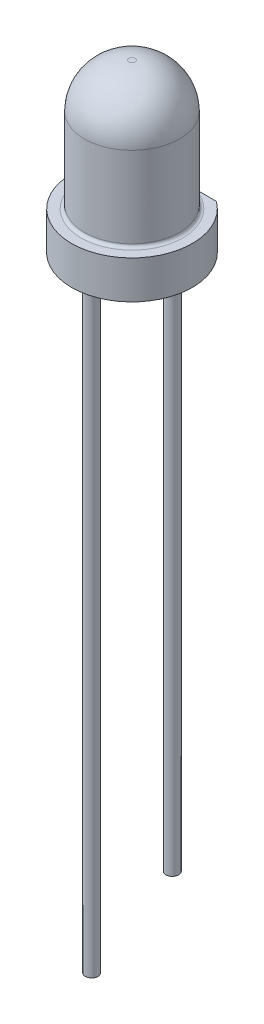
ISO-10303-21;
HEADER;
FILE_DESCRIPTION(('STEP AP214'),'2;1');
FILE_NAME('part.step','',(''),(''),'','','');
FILE_SCHEMA(('AUTOMOTIVE_DESIGN { 1 0 10303 214 1 1 1 1 }'));
ENDSEC;
DATA;
#1=APPLICATION_CONTEXT('core data for automotive mechanical design processes');
#2=APPLICATION_PROTOCOL_DEFINITION('international standard','automotive_design',2000,#1);
#3=PRODUCT_CONTEXT('',#1,'mechanical');
#4=PRODUCT('Part','Part','',(#3));
#5=PRODUCT_RELATED_PRODUCT_CATEGORY('part','',(#4));
#6=PRODUCT_DEFINITION_FORMATION('','',#4);
#7=PRODUCT_DEFINITION_CONTEXT('part definition',#1,'design');
#8=PRODUCT_DEFINITION('design','',#6,#7);
#9=PRODUCT_DEFINITION_SHAPE('','',#8);
#10=(LENGTH_UNIT() NAMED_UNIT(*) SI_UNIT(.MILLI.,.METRE.));
#11=(NAMED_UNIT(*) PLANE_ANGLE_UNIT() SI_UNIT($,.RADIAN.));
#12=(NAMED_UNIT(*) SI_UNIT($,.STERADIAN.) SOLID_ANGLE_UNIT());
#13=UNCERTAINTY_MEASURE_WITH_UNIT(LENGTH_MEASURE(1.E-05),#10,'distance_accuracy_value','');
#14=(GEOMETRIC_REPRESENTATION_CONTEXT(3) GLOBAL_UNCERTAINTY_ASSIGNED_CONTEXT((#13)) GLOBAL_UNIT_ASSIGNED_CONTEXT((#10,
#11,#12)) REPRESENTATION_CONTEXT('',''));
#15=CARTESIAN_POINT('',(0.,0.,0.));
#16=DIRECTION('',(0.,0.,1.));
#17=DIRECTION('',(1.,0.,0.));
#18=AXIS2_PLACEMENT_3D('',#15,#16,#17);
#19=CARTESIAN_POINT('',(0.,0.,0.));
#20=DIRECTION('',(0.,-1.,0.));
#21=DIRECTION('',(0.,0.,-1.));
#22=AXIS2_PLACEMENT_3D('',#19,#20,#21);
#23=PLANE('',#22);
#24=CARTESIAN_POINT('',(0.,0.,-1.27));
#25=DIRECTION('',(0.,-1.,0.));
#26=DIRECTION('',(0.,0.,-1.));
#27=AXIS2_PLACEMENT_3D('',#24,#25,#26);
#28=CIRCLE('',#27,0.2);
#29=CARTESIAN_POINT('',(0.,0.,-1.47));
#30=VERTEX_POINT('',#29);
#31=EDGE_CURVE('E313',#30,#30,#28,.T.);
#32=ORIENTED_EDGE('',*,*,#31,.F.);
#33=EDGE_LOOP('',(#32));
#34=FACE_BOUND('',#33,.T.);
#35=CARTESIAN_POINT('',(0.,0.,1.27));
#36=DIRECTION('',(0.,-1.,0.));
#37=DIRECTION('',(0.,0.,-1.));
#38=AXIS2_PLACEMENT_3D('',#35,#36,#37);
#39=CIRCLE('',#38,0.2);
#40=CARTESIAN_POINT('',(0.,0.,1.07));
#41=VERTEX_POINT('',#40);
#42=EDGE_CURVE('E134',#41,#41,#39,.T.);
#43=ORIENTED_EDGE('',*,*,#42,.F.);
#44=EDGE_LOOP('',(#43));
#45=FACE_BOUND('',#44,.T.);
#46=CARTESIAN_POINT('',(0.,0.,0.));
#47=DIRECTION('',(0.,-1.,0.));
#48=DIRECTION('',(0.,0.,-1.));
#49=AXIS2_PLACEMENT_3D('',#46,#47,#48);
#50=CIRCLE('',#49,1.9);
#51=CARTESIAN_POINT('',(1.15393997640077,0.,-1.50944444444445));
#52=VERTEX_POINT('',#51);
#53=CARTESIAN_POINT('',(-1.15393997640077,0.,-1.50944444444445));
#54=VERTEX_POINT('',#53);
#55=EDGE_CURVE('E127',#52,#54,#50,.T.);
#56=ORIENTED_EDGE('',*,*,#55,.T.);
#57=CARTESIAN_POINT('',(-1.09320629343231,0.,-1.43));
#58=DIRECTION('',(0.,-1.,0.));
#59=DIRECTION('',(0.,0.,-1.));
#60=AXIS2_PLACEMENT_3D('',#57,#58,#59);
#61=CIRCLE('',#60,0.1);
#62=CARTESIAN_POINT('',(-1.09320629343231,0.,-1.53));
#63=VERTEX_POINT('',#62);
#64=EDGE_CURVE('E183',#54,#63,#61,.T.);
#65=ORIENTED_EDGE('',*,*,#64,.T.);
#66=DIRECTION('',(1.,0.,0.));
#67=VECTOR('',#66,1.);
#68=CARTESIAN_POINT('',(-1.5,0.,-1.53));
#69=LINE('',#68,#67);
#70=CARTESIAN_POINT('',(1.09320629343231,0.,-1.53));
#71=VERTEX_POINT('',#70);
#72=EDGE_CURVE('E117',#63,#71,#69,.T.);
#73=ORIENTED_EDGE('',*,*,#72,.T.);
#74=CARTESIAN_POINT('',(1.09320629343231,0.,-1.43));
#75=DIRECTION('',(0.,-1.,0.));
#76=DIRECTION('',(0.,0.,-1.));
#77=AXIS2_PLACEMENT_3D('',#74,#75,#76);
#78=CIRCLE('',#77,0.1);
#79=EDGE_CURVE('E210',#71,#52,#78,.T.);
#80=ORIENTED_EDGE('',*,*,#79,.T.);
#81=EDGE_LOOP('',(#56,#65,#73,#80));
#82=FACE_BOUND('',#81,.T.);
#83=ADVANCED_FACE('F37',(#34,#45,#82),#23,.T.);
#84=CARTESIAN_POINT('',(0.1,5.25,0.));
#85=DIRECTION('',(0.,1.,0.));
#86=DIRECTION('',(0.,0.,1.));
#87=AXIS2_PLACEMENT_3D('',#84,#85,#86);
#88=PLANE('',#87);
#89=CARTESIAN_POINT('',(0.,5.25,0.));
#90=DIRECTION('',(0.,-1.,0.));
#91=DIRECTION('',(0.,0.,-1.));
#92=AXIS2_PLACEMENT_3D('',#89,#90,#91);
#93=CIRCLE('',#92,0.1);
#94=CARTESIAN_POINT('',(0.,5.25,-0.1));
#95=VERTEX_POINT('',#94);
#96=EDGE_CURVE('E195',#95,#95,#93,.T.);
#97=ORIENTED_EDGE('',*,*,#96,.F.);
#98=EDGE_LOOP('',(#97));
#99=FACE_BOUND('',#98,.T.);
#100=ADVANCED_FACE('F162',(#99),#88,.T.);
#101=CARTESIAN_POINT('',(0.,3.85,0.));
#102=DIRECTION('',(0.,-1.,0.));
#103=DIRECTION('',(0.,0.,-1.));
#104=AXIS2_PLACEMENT_3D('',#101,#102,#103);
#105=DEGENERATE_TOROIDAL_SURFACE('',#104,0.1,1.4,.T.);
#106=ORIENTED_EDGE('',*,*,#96,.T.);
#107=EDGE_LOOP('',(#106));
#108=FACE_BOUND('',#107,.T.);
#109=CARTESIAN_POINT('',(0.,3.85,0.));
#110=DIRECTION('',(0.,-1.,0.));
#111=DIRECTION('',(0.,0.,-1.));
#112=AXIS2_PLACEMENT_3D('',#109,#110,#111);
#113=CIRCLE('',#112,1.5);
#114=CARTESIAN_POINT('',(0.,3.85,-1.5));
#115=VERTEX_POINT('',#114);
#116=EDGE_CURVE('E198',#115,#115,#113,.T.);
#117=ORIENTED_EDGE('',*,*,#116,.F.);
#118=EDGE_LOOP('',(#117));
#119=FACE_BOUND('',#118,.T.);
#120=ADVANCED_FACE('F168',(#108,#119),#105,.T.);
#121=CARTESIAN_POINT('',(0.,0.,0.));
#122=DIRECTION('',(0.,-1.,0.));
#123=DIRECTION('',(0.,0.,-1.));
#124=AXIS2_PLACEMENT_3D('',#121,#122,#123);
#125=CYLINDRICAL_SURFACE('',#124,1.5);
#126=CARTESIAN_POINT('',(0.596635949045258,1.27844838329799,-1.37623600603489));
#127=CARTESIAN_POINT('',(0.579988654836086,1.22074362828819,-1.38345306338259));
#128=CARTESIAN_POINT('',(0.593571128968101,1.19395535467138,-1.43595984261225));
#129=CARTESIAN_POINT('',(0.607153603100116,1.16716708105457,-1.4884666218419));
#130=CARTESIAN_POINT('',(0.636411678981608,1.2,-1.53));
#131=CARTESIAN_POINT('',(0.585036841780166,1.28263813999001,-1.38126781091185));
#132=CARTESIAN_POINT('',(0.571302463719679,1.22599416612077,-1.38706443709447));
#133=CARTESIAN_POINT('',(0.584305659045327,1.19828171330966,-1.43698733020298));
#134=CARTESIAN_POINT('',(0.597479746886338,1.17050639970074,-1.48687857662004));
#135=CARTESIAN_POINT('',(0.624039297898998,1.2,-1.53));
#136=CARTESIAN_POINT('',(0.573187867718047,1.28599119272939,-1.38622735770545));
#137=CARTESIAN_POINT('',(0.561678229660388,1.23060501398405,-1.39097132711862));
#138=CARTESIAN_POINT('',(0.574226791445767,1.20220692852279,-1.43848650602435));
#139=CARTESIAN_POINT('',(0.586930229864933,1.17376106597824,-1.48597256818874));
#140=CARTESIAN_POINT('',(0.61140039223266,1.2,-1.53));
#141=CARTESIAN_POINT('',(0.549178576915518,1.2913921514648,-1.39591095345598));
#142=CARTESIAN_POINT('',(0.541297577119814,1.2386162598478,-1.3989909676858));
#143=CARTESIAN_POINT('',(0.552983697349845,1.2092767962256,-1.44206424442007));
#144=CARTESIAN_POINT('',(0.564815785403716,1.17988505157303,-1.48511591745898));
#145=CARTESIAN_POINT('',(0.585790482043143,1.2,-1.53));
#146=CARTESIAN_POINT('',(0.537019422386753,1.29344434684456,-1.40063572853451));
#147=CARTESIAN_POINT('',(0.530537683708682,1.24204647830918,-1.40310920461877));
#148=CARTESIAN_POINT('',(0.541823179280551,1.21242399295138,-1.44414087000428));
#149=CARTESIAN_POINT('',(0.553243424841939,1.18276788571251,-1.48514789033228));
#150=CARTESIAN_POINT('',(0.572820717212384,1.2,-1.53));
#151=CARTESIAN_POINT('',(0.512616344627985,1.2966193956014,-1.40974943255995));
#152=CARTESIAN_POINT('',(0.508480507002836,1.24788019580522,-1.41124206800611));
#153=CARTESIAN_POINT('',(0.518999560235381,1.2179612194423,-1.44850016292976));
#154=CARTESIAN_POINT('',(0.529651702044954,1.18801086515299,-1.48573176900494));
#155=CARTESIAN_POINT('',(0.546790767603336,1.2,-1.53));
#156=CARTESIAN_POINT('',(0.500374338951784,1.29775093441029,-1.41414113720348));
#157=CARTESIAN_POINT('',(0.497178556171205,1.25030934586726,-1.41526471895034));
#158=CARTESIAN_POINT('',(0.507342274687659,1.22035819106882,-1.4507806739017));
#159=CARTESIAN_POINT('',(0.517624678401709,1.19038570693231,-1.48627323443446));
#160=CARTESIAN_POINT('',(0.533732628215766,1.2,-1.53));
#161=CARTESIAN_POINT('',(0.475735547941032,1.29931674867054,-1.42261924900392));
#162=CARTESIAN_POINT('',(0.47412551748095,1.25438269775188,-1.42314955042351));
#163=CARTESIAN_POINT('',(0.483596203260389,1.2245481664658,-1.45542113040316));
#164=CARTESIAN_POINT('',(0.49318342175339,1.1946934570346,-1.48767013672499));
#165=CARTESIAN_POINT('',(0.507451251137652,1.2,-1.53));
#166=CARTESIAN_POINT('',(0.463338632072527,1.2997503896142,-1.426705375124));
#167=CARTESIAN_POINT('',(0.462361785715185,1.25603684322798,-1.42701885718742));
#168=CARTESIAN_POINT('',(0.47150703491985,1.22634061945737,-1.45778114622854));
#169=CARTESIAN_POINT('',(0.480754989806089,1.19663341865014,-1.48852378191264));
#170=CARTESIAN_POINT('',(0.494227874210891,1.2,-1.53));
#171=CARTESIAN_POINT('',(0.41471094272655,1.30041340749933,-1.44203056474712));
#172=CARTESIAN_POINT('',(0.416213299518517,1.261222769485,-1.44154104006249));
#173=CARTESIAN_POINT('',(0.423733878620772,1.23235282442122,-1.46692270832985));
#174=CARTESIAN_POINT('',(0.432123864507955,1.20336789692869,-1.49213801328945));
#175=CARTESIAN_POINT('',(0.44235833890775,1.2,-1.53));
#176=CARTESIAN_POINT('',(0.378077766422061,1.29867898574596,-1.45206286838238));
#177=CARTESIAN_POINT('',(0.380169640792389,1.26255365008559,-1.45151257699511));
#178=CARTESIAN_POINT('',(0.38698553795431,1.23468939564989,-1.47356029599259));
#179=CARTESIAN_POINT('',(0.394401907167303,1.20679996719503,-1.49551475520822));
#180=CARTESIAN_POINT('',(0.4032829508504,1.2,-1.53));
#181=CARTESIAN_POINT('',(0.30425871854931,1.2932828552766,-1.46930957357808));
#182=CARTESIAN_POINT('',(0.307079951419319,1.26250202741913,-1.46871132062124));
#183=CARTESIAN_POINT('',(0.31233461227565,1.23698092941371,-1.48535267215074));
#184=CARTESIAN_POINT('',(0.318173795207326,1.21144853710192,-1.50190011559484));
#185=CARTESIAN_POINT('',(0.324542633119835,1.2,-1.53));
#186=CARTESIAN_POINT('',(0.267071892964728,1.28961732179085,-1.47651833323522));
#187=CARTESIAN_POINT('',(0.269807489469149,1.26115657812262,-1.47603269280316));
#188=CARTESIAN_POINT('',(0.274429877766994,1.23693114785473,-1.49050448646882));
#189=CARTESIAN_POINT('',(0.279427902981026,1.21271070690526,-1.50493476730807));
#190=CARTESIAN_POINT('',(0.284876685829209,1.2,-1.53));
#191=CARTESIAN_POINT('',(0.192041759882336,1.28223633010451,-1.48814264083676));
#192=CARTESIAN_POINT('',(0.194448175117998,1.2576845929024,-1.48783135106648));
#193=CARTESIAN_POINT('',(0.197652369009453,1.23588414150975,-1.49894144908285));
#194=CARTESIAN_POINT('',(0.201230232249616,1.21408891846235,-1.51001071885433));
#195=CARTESIAN_POINT('',(0.204844543874352,1.2,-1.53));
#196=CARTESIAN_POINT('',(0.154195919935727,1.27852070647174,-1.49254204929815));
#197=CARTESIAN_POINT('',(0.156163965999515,1.25555199056608,-1.49235163064919));
#198=CARTESIAN_POINT('',(0.158775311449008,1.23488152319566,-1.50221580073815));
#199=CARTESIAN_POINT('',(0.161573097274758,1.21421329490168,-1.51206957814087));
#200=CARTESIAN_POINT('',(0.164475647931405,1.2,-1.53));
#201=CARTESIAN_POINT('',(0.078213791192061,1.27313765714223,-1.49844202742775));
#202=CARTESIAN_POINT('',(0.0793316733717928,1.25236443947991,-1.49839249164291));
#203=CARTESIAN_POINT('',(0.0805991124199562,1.23329053926251,-1.50662579467846));
#204=CARTESIAN_POINT('',(0.0820482117256914,1.21422188025386,-1.51484872637576));
#205=CARTESIAN_POINT('',(0.0834280439382357,1.2,-1.53));
#206=CARTESIAN_POINT('',(0.0400784190140926,1.27146533050907,-1.49994953841275));
#207=CARTESIAN_POINT('',(0.0406074388213395,1.25129448361804,-1.49994828479541));
#208=CARTESIAN_POINT('',(0.0413012098826571,1.23270118386836,-1.50776655797306));
#209=CARTESIAN_POINT('',(0.0419976948104199,1.21410780763926,-1.51558492151257));
#210=CARTESIAN_POINT('',(0.0427503136150422,1.2,-1.53));
#211=CARTESIAN_POINT('',(-0.0369667796354504,1.27136485923424,-1.50004894388315));
#212=CARTESIAN_POINT('',(-0.037451767744919,1.25123255682875,-1.5000501519944));
#213=CARTESIAN_POINT('',(-0.0380946287051991,1.23266827187658,-1.50784140770821));
#214=CARTESIAN_POINT('',(-0.0387339859337747,1.2141040675329,-1.51563256534065));
#215=CARTESIAN_POINT('',(-0.0394312316111574,1.2,-1.53));
#216=CARTESIAN_POINT('',(-0.0758767848599048,1.27300251396075,-1.49858170121813));
#217=CARTESIAN_POINT('',(-0.0769686631054567,1.2522824653133,-1.49853559503684));
#218=CARTESIAN_POINT('',(-0.0781927885150225,1.23324795415863,-1.50673073642604));
#219=CARTESIAN_POINT('',(-0.0796032813064427,1.21421892907304,-1.51491531115792));
#220=CARTESIAN_POINT('',(-0.0809352371839013,1.2,-1.53));
#221=CARTESIAN_POINT('',(-0.153405059561358,1.27843408641926,-1.49264377719626));
#222=CARTESIAN_POINT('',(-0.15536898568105,1.25550238502165,-1.49245548351361));
#223=CARTESIAN_POINT('',(-0.157963440051553,1.23485815676662,-1.50229127066718));
#224=CARTESIAN_POINT('',(-0.160749384521687,1.21421605686533,-1.51211659706847));
#225=CARTESIAN_POINT('',(-0.163632063532112,1.2,-1.53));
#226=CARTESIAN_POINT('',(-0.192022281181801,1.28223371326418,-1.48816513794087));
#227=CARTESIAN_POINT('',(-0.194439211654154,1.2576886068525,-1.4878523459794));
#228=CARTESIAN_POINT('',(-0.197634520231691,1.23588986910119,-1.49895659925115));
#229=CARTESIAN_POINT('',(-0.201220003891631,1.21409658323617,-1.510018136887));
#230=CARTESIAN_POINT('',(-0.204823766593921,1.2,-1.53));
#231=CARTESIAN_POINT('',(-0.268660382395489,1.28977423475865,-1.47625242622609));
#232=CARTESIAN_POINT('',(-0.271409661781654,1.26122578895328,-1.47576172149049));
#233=CARTESIAN_POINT('',(-0.276053266062757,1.23694716925973,-1.49031267276247));
#234=CARTESIAN_POINT('',(-0.281091372471785,1.21267367601031,-1.50481984447215));
#235=CARTESIAN_POINT('',(-0.286571074555189,1.2,-1.53));
#236=CARTESIAN_POINT('',(-0.306682829490062,1.29351528382897,-1.46882833250248));
#237=CARTESIAN_POINT('',(-0.309517382781105,1.26258105276251,-1.46822109991684));
#238=CARTESIAN_POINT('',(-0.314803586057846,1.23697612531768,-1.48501008854549));
#239=CARTESIAN_POINT('',(-0.320708404402393,1.21135833529395,-1.50169876563366));
#240=CARTESIAN_POINT('',(-0.327128351456066,1.2,-1.53));
#241=CARTESIAN_POINT('',(-0.38211659886271,1.29891233437488,-1.45102703848495));
#242=CARTESIAN_POINT('',(-0.384160774280792,1.26247032543957,-1.4504823096191));
#243=CARTESIAN_POINT('',(-0.391049347918864,1.23448669578774,-1.47286822446213));
#244=CARTESIAN_POINT('',(-0.398572869870511,1.20647489908179,-1.49515485007498));
#245=CARTESIAN_POINT('',(-0.40759103878689,1.2,-1.53));
#246=CARTESIAN_POINT('',(-0.419529334626983,1.30057414689707,-1.44065816834881));
#247=CARTESIAN_POINT('',(-0.4209412107273,1.26096487084678,-1.4401839984387));
#248=CARTESIAN_POINT('',(-0.428548000768911,1.23197544529759,-1.46603329061811));
#249=CARTESIAN_POINT('',(-0.437079374618921,1.20285817027594,-1.49170446778168));
#250=CARTESIAN_POINT('',(-0.447497956935449,1.2,-1.53));
#251=CARTESIAN_POINT('',(-0.468791184304815,1.29957738484036,-1.4249221530695));
#252=CARTESIAN_POINT('',(-0.467539174030466,1.25533306146782,-1.42532998072905));
#253=CARTESIAN_POINT('',(-0.476829345937057,1.22557093742464,-1.45674740230909));
#254=CARTESIAN_POINT('',(-0.486222733276246,1.19579689151023,-1.48814507156556));
#255=CARTESIAN_POINT('',(-0.500043929925136,1.2,-1.53));
#256=CARTESIAN_POINT('',(-0.481078358933183,1.29905844422898,-1.42082037197495));
#257=CARTESIAN_POINT('',(-0.479162158946364,1.25358914282929,-1.42146038584177));
#258=CARTESIAN_POINT('',(-0.488779133791034,1.22371054839857,-1.4544069674999));
#259=CARTESIAN_POINT('',(-0.498513274808875,1.19380982550644,-1.48733118860187));
#260=CARTESIAN_POINT('',(-0.513150249528728,1.2,-1.53));
#261=CARTESIAN_POINT('',(-0.505524926485509,1.29729897943894,-1.41230757412135));
#262=CARTESIAN_POINT('',(-0.50194085216485,1.24931724873431,-1.41358324462378));
#263=CARTESIAN_POINT('',(-0.51225544594631,1.21937200423796,-1.44982187734587));
#264=CARTESIAN_POINT('',(-0.522689394944279,1.18940518358734,-1.48603666998433));
#265=CARTESIAN_POINT('',(-0.539226588251209,1.2,-1.53));
#266=CARTESIAN_POINT('',(-0.517684019402311,1.29605703333797,-1.40789596310237));
#267=CARTESIAN_POINT('',(-0.513107339978204,1.24677661967967,-1.40956831709867));
#268=CARTESIAN_POINT('',(-0.523781088462639,1.21689263727398,-1.44757742012227));
#269=CARTESIAN_POINT('',(-0.534587524046544,1.18697917026052,-1.48555916245719));
#270=CARTESIAN_POINT('',(-0.552196287362465,1.2,-1.53));
#271=CARTESIAN_POINT('',(-0.52974592643691,1.2943624851959,-1.4033421726092));
#272=CARTESIAN_POINT('',(-0.523882563776283,1.24377450108468,-1.40555552623408));
#273=CARTESIAN_POINT('',(-0.535005835081248,1.21405404063005,-1.44544774550345));
#274=CARTESIAN_POINT('',(-0.546129106386214,1.18433358017542,-1.48533996477283));
#275=CARTESIAN_POINT('',(-0.565062321532704,1.2,-1.53));
#276=(BOUNDED_SURFACE() B_SPLINE_SURFACE(3,2,((#126,#127,#128,#129,#130),(#131,#132,#133,#134,
#135),(#136,#137,#138,#139,#140),(#141,#142,#143,#144,#145),(#146,#147,#148,#149,#150),(#151,
#152,#153,#154,#155),(#156,#157,#158,#159,#160),(#161,#162,#163,#164,#165),(#166,#167,#168,#169,
#170),(#171,#172,#173,#174,#175),(#176,#177,#178,#179,#180),(#181,#182,#183,#184,#185),(#186,
#187,#188,#189,#190),(#191,#192,#193,#194,#195),(#196,#197,#198,#199,#200),(#201,#202,#203,#204,
#205),(#206,#207,#208,#209,#210),(#211,#212,#213,#214,#215),(#216,#217,#218,#219,#220),(#221,
#222,#223,#224,#225),(#226,#227,#228,#229,#230),(#231,#232,#233,#234,#235),(#236,#237,#238,#239,
#240),(#241,#242,#243,#244,#245),(#246,#247,#248,#249,#250),(#251,#252,#253,#254,#255),(#256,
#257,#258,#259,#260),(#261,#262,#263,#264,#265),(#266,#267,#268,#269,#270),(#271,#272,#273,#274,
#275)),.UNSPECIFIED.,.F.,.F.,.F.) B_SPLINE_SURFACE_WITH_KNOTS((4,2,2,2,2,2,2,2,2,2,2,2,2,2,4),
(3,2,3),(0.,0.0422764840743587,0.0844128324877446,0.126146902745886,0.167918894971379,
0.28928862457798,0.410899648455466,0.533203176922212,0.655212775535734,0.779671660012366,
0.904460738177825,1.02883061205741,1.15285211513145,1.19431278140056,1.23585526443215),(0.,0.5,
1.),.UNSPECIFIED.) GEOMETRIC_REPRESENTATION_ITEM() RATIONAL_B_SPLINE_SURFACE(((1.,
0.85563716515644,1.,0.85563716515644,1.),(1.,0.863021020647195,1.,0.863021020647195,1.),(1.,
0.869758422118352,1.,0.869758422118352,1.),(1.,0.882160721151865,1.,0.882160721151865,1.),(1.,
0.88782909976125,1.,0.88782909976125,1.),(1.,0.898309242198533,1.,0.898309242198533,1.),(1.,
0.903128667525479,1.,0.903128667525479,1.),(1.,0.91211879180689,1.,0.91211879180689,1.),(1.,
0.916288897312207,1.,0.916288897312207,1.),(1.,0.931529217847124,1.,0.931529217847124,1.),(1.,
0.940605969691848,1.,0.940605969691848,1.),(1.,0.955654895603525,1.,0.955654895603525,1.),(1.,
0.961620861606153,1.,0.961620861606153,1.),(1.,0.971051666979564,1.,0.971051666979564,1.),(1.,
0.974502070422679,1.,0.974502070422679,1.),(1.,0.979101248220992,1.,0.979101248220992,1.),(1.,
0.980255534110944,1.,0.980255534110944,1.),(1.,0.980332213292014,1.,0.980332213292014,1.),(1.,
0.97920933721665,1.,0.97920933721665,1.),(1.,0.974582188133946,1.,0.974582188133946,1.),(1.,
0.97107160510234,1.,0.97107160510234,1.),(1.,0.961403426510486,1.,0.961403426510486,1.),(1.,
0.955254762683174,1.,0.955254762683174,1.),(1.,0.939678908407238,1.,0.939678908407238,1.),(1.,
0.930260949639035,1.,0.930260949639035,1.),(1.,0.91447462621072,1.,0.91447462621072,1.),(1.,
0.910249755048433,1.,0.910249755048433,1.),(1.,0.901125501382839,1.,0.901125501382839,1.),(1.,
0.896224804279032,1.,0.896224804279032,1.),(1.,0.890926593829613,1.,0.890926593829613,1.))) REPRESENTATION_ITEM('') SURFACE());
#277=CARTESIAN_POINT('',(0.596635949045258,1.27844838329799,-1.37623600603489));
#278=CARTESIAN_POINT('',(0.585036841780166,1.28263813999001,-1.38126781091185));
#279=CARTESIAN_POINT('',(0.573187867718047,1.28599119272939,-1.38622735770545));
#280=CARTESIAN_POINT('',(0.549178576915518,1.2913921514648,-1.39591095345598));
#281=CARTESIAN_POINT('',(0.537019422386753,1.29344434684455,-1.40063572853451));
#282=CARTESIAN_POINT('',(0.512616344627985,1.2966193956014,-1.40974943255995));
#283=CARTESIAN_POINT('',(0.500374338951784,1.29775093441029,-1.41414113720348));
#284=CARTESIAN_POINT('',(0.475735547941032,1.29931674867054,-1.42261924900392));
#285=CARTESIAN_POINT('',(0.463338632072527,1.2997503896142,-1.426705375124));
#286=CARTESIAN_POINT('',(0.41471094272655,1.30041340749933,-1.44203056474712));
#287=CARTESIAN_POINT('',(0.378077766422061,1.29867898574596,-1.45206286838238));
#288=CARTESIAN_POINT('',(0.30425871854931,1.2932828552766,-1.46930957357808));
#289=CARTESIAN_POINT('',(0.267071892964728,1.28961732179085,-1.47651833323522));
#290=CARTESIAN_POINT('',(0.192041759882336,1.28223633010451,-1.48814264083676));
#291=CARTESIAN_POINT('',(0.154195919935727,1.27852070647174,-1.49254204929814));
#292=CARTESIAN_POINT('',(0.078213791192061,1.27313765714222,-1.49844202742775));
#293=CARTESIAN_POINT('',(0.0400784190140926,1.27146533050907,-1.49994953841275));
#294=CARTESIAN_POINT('',(-0.0369667796354504,1.27136485923424,-1.50004894388315));
#295=CARTESIAN_POINT('',(-0.0758767848599049,1.27300251396075,-1.49858170121813));
#296=CARTESIAN_POINT('',(-0.153405059561358,1.27843408641926,-1.49264377719626));
#297=CARTESIAN_POINT('',(-0.192022281181801,1.28223371326418,-1.48816513794087));
#298=CARTESIAN_POINT('',(-0.268660382395489,1.28977423475865,-1.47625242622609));
#299=CARTESIAN_POINT('',(-0.306682829490062,1.29351528382897,-1.46882833250248));
#300=CARTESIAN_POINT('',(-0.38211659886271,1.29891233437488,-1.45102703848495));
#301=CARTESIAN_POINT('',(-0.419529334626983,1.30057414689707,-1.44065816834881));
#302=CARTESIAN_POINT('',(-0.468791184304815,1.29957738484036,-1.4249221530695));
#303=CARTESIAN_POINT('',(-0.481078358933183,1.29905844422898,-1.42082037197495));
#304=CARTESIAN_POINT('',(-0.505524926485509,1.29729897943894,-1.41230757412135));
#305=CARTESIAN_POINT('',(-0.517684019402311,1.29605703333797,-1.40789596310237));
#306=CARTESIAN_POINT('',(-0.52974592643691,1.2943624851959,-1.4033421726092));
#307=B_SPLINE_CURVE_WITH_KNOTS('',3,(#277,#278,#279,#280,#281,#282,#283,#284,#285,#286,#287,
#288,#289,#290,#291,#292,#293,#294,#295,#296,#297,#298,#299,#300,#301,#302,#303,#304,#305,#306),
.UNSPECIFIED.,.F.,.F.,(4,2,2,2,2,2,2,2,2,2,2,2,2,2,4),(0.,0.0422764840743587,0.0844128324877446,
0.126146902745886,0.167918894971379,0.28928862457798,0.410899648455466,0.533203176922212,
0.655212775535734,0.779671660012366,0.904460738177825,1.02883061205741,1.15285211513145,
1.19431278140056,1.23585526443215),.UNSPECIFIED.);
#308=CARTESIAN_POINT('',(0.438826115192566,1.3,-1.434375));
#309=VERTEX_POINT('',#308);
#310=CARTESIAN_POINT('',(-0.438826115192566,1.3,-1.434375));
#311=VERTEX_POINT('',#310);
#312=EDGE_CURVE('E51',#309,#311,#307,.T.);
#313=ORIENTED_EDGE('',*,*,#312,.T.);
#314=CARTESIAN_POINT('',(0.,1.3,0.));
#315=DIRECTION('',(0.,1.,0.));
#316=DIRECTION('',(0.,0.,1.));
#317=AXIS2_PLACEMENT_3D('',#314,#315,#316);
#318=CIRCLE('',#317,1.5);
#319=EDGE_CURVE('E11',#311,#309,#318,.T.);
#320=ORIENTED_EDGE('',*,*,#319,.T.);
#321=EDGE_LOOP('',(#313,#320));
#322=FACE_BOUND('',#321,.T.);
#323=ORIENTED_EDGE('',*,*,#116,.T.);
#324=EDGE_LOOP('',(#323));
#325=FACE_BOUND('',#324,.T.);
#326=ADVANCED_FACE('F160',(#322,#325),#125,.T.);
#327=CARTESIAN_POINT('',(1.9,1.2,0.));
#328=DIRECTION('',(0.,1.,0.));
#329=DIRECTION('',(0.,0.,1.));
#330=AXIS2_PLACEMENT_3D('',#327,#328,#329);
#331=PLANE('',#330);
#332=DIRECTION('',(1.,0.,0.));
#333=VECTOR('',#332,1.);
#334=CARTESIAN_POINT('',(-1.5,1.2,-1.53));
#335=LINE('',#334,#333);
#336=CARTESIAN_POINT('',(-1.09320629343231,1.2,-1.53));
#337=VERTEX_POINT('',#336);
#338=CARTESIAN_POINT('',(-0.468081189538737,1.2,-1.53));
#339=VERTEX_POINT('',#338);
#340=EDGE_CURVE('E114',#337,#339,#335,.T.);
#341=ORIENTED_EDGE('',*,*,#340,.F.);
#342=CARTESIAN_POINT('',(-1.09320629343231,1.2,-1.43));
#343=DIRECTION('',(0.,1.,0.));
#344=DIRECTION('',(0.,0.,1.));
#345=AXIS2_PLACEMENT_3D('',#342,#343,#344);
#346=CIRCLE('',#345,0.1);
#347=CARTESIAN_POINT('',(-1.15393997640077,1.2,-1.50944444444445));
#348=VERTEX_POINT('',#347);
#349=EDGE_CURVE('E96',#337,#348,#346,.T.);
#350=ORIENTED_EDGE('',*,*,#349,.T.);
#351=CARTESIAN_POINT('',(0.,1.2,0.));
#352=DIRECTION('',(0.,-1.,0.));
#353=DIRECTION('',(0.,0.,-1.));
#354=AXIS2_PLACEMENT_3D('',#351,#352,#353);
#355=CIRCLE('',#354,1.9);
#356=CARTESIAN_POINT('',(1.15393997640077,1.2,-1.50944444444445));
#357=VERTEX_POINT('',#356);
#358=EDGE_CURVE('E200',#357,#348,#355,.T.);
#359=ORIENTED_EDGE('',*,*,#358,.F.);
#360=CARTESIAN_POINT('',(1.09320629343231,1.2,-1.43));
#361=DIRECTION('',(0.,1.,0.));
#362=DIRECTION('',(0.,0.,1.));
#363=AXIS2_PLACEMENT_3D('',#360,#361,#362);
#364=CIRCLE('',#363,0.1);
#365=CARTESIAN_POINT('',(1.09320629343231,1.2,-1.53));
#366=VERTEX_POINT('',#365);
#367=EDGE_CURVE('E107',#357,#366,#364,.T.);
#368=ORIENTED_EDGE('',*,*,#367,.T.);
#369=CARTESIAN_POINT('',(0.468081189538737,1.2,-1.53));
#370=VERTEX_POINT('',#369);
#371=EDGE_CURVE('E126',#370,#366,#335,.T.);
#372=ORIENTED_EDGE('',*,*,#371,.F.);
#373=CARTESIAN_POINT('',(0.,1.2,0.));
#374=DIRECTION('',(0.,1.,0.));
#375=DIRECTION('',(0.,0.,1.));
#376=AXIS2_PLACEMENT_3D('',#373,#374,#375);
#377=CIRCLE('',#376,1.6);
#378=EDGE_CURVE('E118',#370,#339,#377,.F.);
#379=ORIENTED_EDGE('',*,*,#378,.T.);
#380=EDGE_LOOP('',(#341,#350,#359,#368,#372,#379));
#381=FACE_BOUND('',#380,.T.);
#382=ADVANCED_FACE('F121',(#381),#331,.T.);
#383=CARTESIAN_POINT('',(0.,0.,0.));
#384=DIRECTION('',(0.,-1.,0.));
#385=DIRECTION('',(0.,0.,-1.));
#386=AXIS2_PLACEMENT_3D('',#383,#384,#385);
#387=CYLINDRICAL_SURFACE('',#386,1.9);
#388=ORIENTED_EDGE('',*,*,#358,.T.);
#389=DIRECTION('',(0.,-1.,0.));
#390=VECTOR('',#389,1.);
#391=CARTESIAN_POINT('',(-1.15393997640077,0.,-1.50944444444445));
#392=LINE('',#391,#390);
#393=EDGE_CURVE('E101',#348,#54,#392,.T.);
#394=ORIENTED_EDGE('',*,*,#393,.T.);
#395=ORIENTED_EDGE('',*,*,#55,.F.);
#396=DIRECTION('',(0.,-1.,0.));
#397=VECTOR('',#396,1.);
#398=CARTESIAN_POINT('',(1.15393997640077,0.,-1.50944444444445));
#399=LINE('',#398,#397);
#400=EDGE_CURVE('E106',#52,#357,#399,.F.);
#401=ORIENTED_EDGE('',*,*,#400,.T.);
#402=EDGE_LOOP('',(#388,#394,#395,#401));
#403=FACE_BOUND('',#402,.T.);
#404=ADVANCED_FACE('F152',(#403),#387,.T.);
#405=CARTESIAN_POINT('',(-1.5,-3.04138126514911,-1.53));
#406=DIRECTION('',(0.,0.,1.));
#407=DIRECTION('',(1.,0.,0.));
#408=AXIS2_PLACEMENT_3D('',#405,#406,#407);
#409=PLANE('',#408);
#410=ORIENTED_EDGE('',*,*,#72,.F.);
#411=DIRECTION('',(0.,1.,0.));
#412=VECTOR('',#411,1.);
#413=CARTESIAN_POINT('',(-1.09320629343231,1.2,-1.53));
#414=LINE('',#413,#412);
#415=EDGE_CURVE('E100',#63,#337,#414,.T.);
#416=ORIENTED_EDGE('',*,*,#415,.T.);
#417=ORIENTED_EDGE('',*,*,#340,.T.);
#418=EDGE_CURVE('E124',#339,#370,#335,.T.);
#419=ORIENTED_EDGE('',*,*,#418,.T.);
#420=ORIENTED_EDGE('',*,*,#371,.T.);
#421=DIRECTION('',(0.,1.,0.));
#422=VECTOR('',#421,1.);
#423=CARTESIAN_POINT('',(1.09320629343231,0.,-1.53));
#424=LINE('',#423,#422);
#425=EDGE_CURVE('E119',#366,#71,#424,.F.);
#426=ORIENTED_EDGE('',*,*,#425,.T.);
#427=EDGE_LOOP('',(#410,#416,#417,#419,#420,#426));
#428=FACE_BOUND('',#427,.T.);
#429=ADVANCED_FACE('F112',(#428),#409,.F.);
#430=CARTESIAN_POINT('',(-1.09320629343231,0.,-1.43));
#431=DIRECTION('',(0.,-1.,0.));
#432=DIRECTION('',(0.,0.,-1.));
#433=AXIS2_PLACEMENT_3D('',#430,#431,#432);
#434=CYLINDRICAL_SURFACE('',#433,0.1);
#435=ORIENTED_EDGE('',*,*,#64,.F.);
#436=ORIENTED_EDGE('',*,*,#393,.F.);
#437=ORIENTED_EDGE('',*,*,#349,.F.);
#438=ORIENTED_EDGE('',*,*,#415,.F.);
#439=EDGE_LOOP('',(#435,#436,#437,#438));
#440=FACE_BOUND('',#439,.T.);
#441=ADVANCED_FACE('F99',(#440),#434,.T.);
#442=CARTESIAN_POINT('',(1.09320629343231,0.,-1.43));
#443=DIRECTION('',(0.,-1.,0.));
#444=DIRECTION('',(0.,0.,-1.));
#445=AXIS2_PLACEMENT_3D('',#442,#443,#444);
#446=CYLINDRICAL_SURFACE('',#445,0.1);
#447=ORIENTED_EDGE('',*,*,#367,.F.);
#448=ORIENTED_EDGE('',*,*,#400,.F.);
#449=ORIENTED_EDGE('',*,*,#79,.F.);
#450=ORIENTED_EDGE('',*,*,#425,.F.);
#451=EDGE_LOOP('',(#447,#448,#449,#450));
#452=FACE_BOUND('',#451,.T.);
#453=ADVANCED_FACE('F217',(#452),#446,.T.);
#454=CARTESIAN_POINT('',(0.,1.3,0.));
#455=DIRECTION('',(0.,1.,0.));
#456=DIRECTION('',(0.,0.,1.));
#457=AXIS2_PLACEMENT_3D('',#454,#455,#456);
#458=TOROIDAL_SURFACE('',#457,1.6,0.1);
#459=CARTESIAN_POINT('',(0.468081189538737,1.3,-1.53));
#460=DIRECTION('',(0.95625,0.,0.29255074346171));
#461=DIRECTION('',(0.29255074346171,0.,-0.95625));
#462=AXIS2_PLACEMENT_3D('',#459,#460,#461);
#463=CIRCLE('',#462,0.1);
#464=EDGE_CURVE('E132',#309,#370,#463,.T.);
#465=ORIENTED_EDGE('',*,*,#464,.F.);
#466=ORIENTED_EDGE('',*,*,#319,.F.);
#467=CARTESIAN_POINT('',(-0.468081189538737,1.3,-1.53));
#468=DIRECTION('',(-0.95625,0.,0.29255074346171));
#469=DIRECTION('',(0.29255074346171,0.,0.95625));
#470=AXIS2_PLACEMENT_3D('',#467,#468,#469);
#471=CIRCLE('',#470,0.1);
#472=EDGE_CURVE('E59',#339,#311,#471,.T.);
#473=ORIENTED_EDGE('',*,*,#472,.F.);
#474=ORIENTED_EDGE('',*,*,#378,.F.);
#475=EDGE_LOOP('',(#465,#466,#473,#474));
#476=FACE_BOUND('',#475,.T.);
#477=ADVANCED_FACE('F39',(#476),#458,.F.);
#478=ORIENTED_EDGE('',*,*,#472,.T.);
#479=ORIENTED_EDGE('',*,*,#312,.F.);
#480=ORIENTED_EDGE('',*,*,#464,.T.);
#481=ORIENTED_EDGE('',*,*,#418,.F.);
#482=EDGE_LOOP('',(#478,#479,#480,#481));
#483=FACE_BOUND('',#482,.T.);
#484=ADVANCED_FACE('F142',(#483),#276,.F.);
#485=CARTESIAN_POINT('',(0.,-17.5,1.27));
#486=DIRECTION('',(0.,1.,0.));
#487=DIRECTION('',(0.,0.,1.));
#488=AXIS2_PLACEMENT_3D('',#485,#486,#487);
#489=CYLINDRICAL_SURFACE('',#488,0.2);
#490=ORIENTED_EDGE('',*,*,#42,.T.);
#491=EDGE_LOOP('',(#490));
#492=FACE_BOUND('',#491,.T.);
#493=CARTESIAN_POINT('',(0.,-19.,1.27));
#494=DIRECTION('',(0.,-1.,0.));
#495=DIRECTION('',(0.,0.,-1.));
#496=AXIS2_PLACEMENT_3D('',#493,#494,#495);
#497=CIRCLE('',#496,0.2);
#498=CARTESIAN_POINT('',(0.,-19.,1.07));
#499=VERTEX_POINT('',#498);
#500=EDGE_CURVE('E311',#499,#499,#497,.T.);
#501=ORIENTED_EDGE('',*,*,#500,.F.);
#502=EDGE_LOOP('',(#501));
#503=FACE_BOUND('',#502,.T.);
#504=ADVANCED_FACE('F153',(#492,#503),#489,.T.);
#505=CARTESIAN_POINT('',(0.,-17.5,-1.27));
#506=DIRECTION('',(0.,1.,0.));
#507=DIRECTION('',(0.,0.,1.));
#508=AXIS2_PLACEMENT_3D('',#505,#506,#507);
#509=CYLINDRICAL_SURFACE('',#508,0.2);
#510=CARTESIAN_POINT('',(0.,-17.5,-1.27));
#511=DIRECTION('',(0.,-1.,0.));
#512=DIRECTION('',(0.,0.,-1.));
#513=AXIS2_PLACEMENT_3D('',#510,#511,#512);
#514=CIRCLE('',#513,0.2);
#515=CARTESIAN_POINT('',(0.,-17.5,-1.47));
#516=VERTEX_POINT('',#515);
#517=EDGE_CURVE('E316',#516,#516,#514,.T.);
#518=ORIENTED_EDGE('',*,*,#517,.F.);
#519=EDGE_LOOP('',(#518));
#520=FACE_BOUND('',#519,.T.);
#521=ORIENTED_EDGE('',*,*,#31,.T.);
#522=EDGE_LOOP('',(#521));
#523=FACE_BOUND('',#522,.T.);
#524=ADVANCED_FACE('F272',(#520,#523),#509,.T.);
#525=CARTESIAN_POINT('',(0.,-17.5,-1.27));
#526=DIRECTION('',(0.,-1.,0.));
#527=DIRECTION('',(0.,0.,-1.));
#528=AXIS2_PLACEMENT_3D('',#525,#526,#527);
#529=PLANE('',#528);
#530=ORIENTED_EDGE('',*,*,#517,.T.);
#531=EDGE_LOOP('',(#530));
#532=FACE_BOUND('',#531,.T.);
#533=ADVANCED_FACE('F277',(#532),#529,.T.);
#534=CARTESIAN_POINT('',(0.,-19.,1.27));
#535=DIRECTION('',(0.,-1.,0.));
#536=DIRECTION('',(0.,0.,-1.));
#537=AXIS2_PLACEMENT_3D('',#534,#535,#536);
#538=PLANE('',#537);
#539=ORIENTED_EDGE('',*,*,#500,.T.);
#540=EDGE_LOOP('',(#539));
#541=FACE_BOUND('',#540,.T.);
#542=ADVANCED_FACE('F288',(#541),#538,.T.);
#543=CLOSED_SHELL('',(#83,#100,#120,#326,#382,#404,#429,#441,#453,#477,#484,#504,#524,#533,#542));
#544=MANIFOLD_SOLID_BREP('B2',#543);
#545=ADVANCED_BREP_SHAPE_REPRESENTATION('',(#18,#544),#14);
#546=SHAPE_DEFINITION_REPRESENTATION(#9,#545);
ENDSEC;
END-ISO-10303-21;
